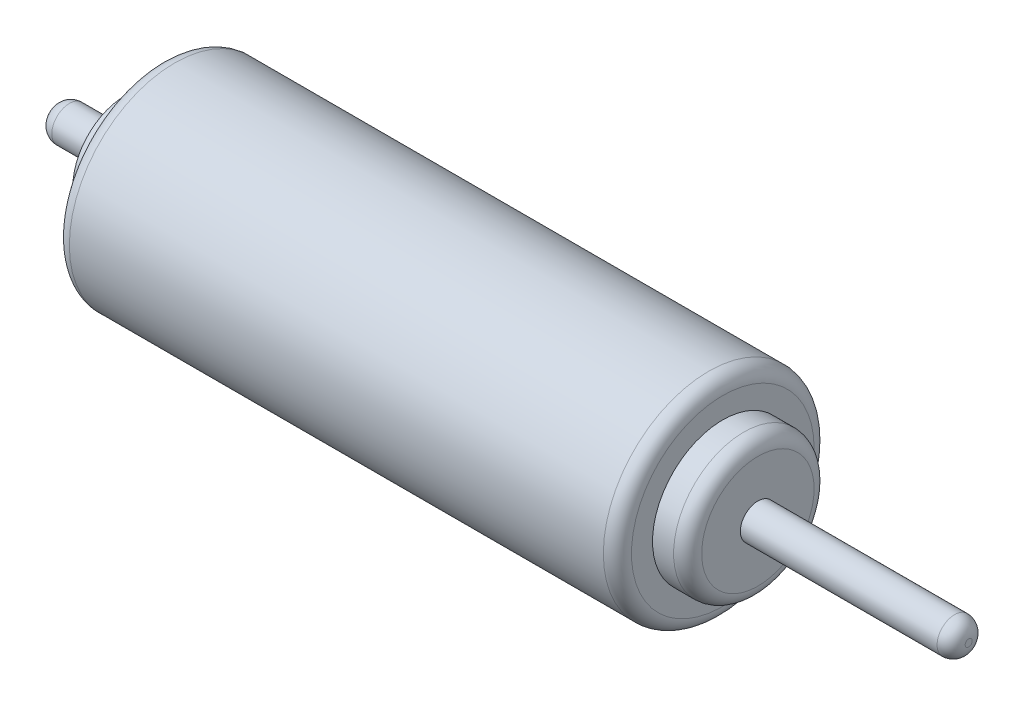
ISO-10303-21;
HEADER;
FILE_DESCRIPTION(('STEP AP214'),'2;1');
FILE_NAME('part.step','',(''),(''),'','','');
FILE_SCHEMA(('AUTOMOTIVE_DESIGN { 1 0 10303 214 1 1 1 1 }'));
ENDSEC;
DATA;
#1=APPLICATION_CONTEXT('core data for automotive mechanical design processes');
#2=APPLICATION_PROTOCOL_DEFINITION('international standard','automotive_design',2000,#1);
#3=PRODUCT_CONTEXT('',#1,'mechanical');
#4=PRODUCT('Part','Part','',(#3));
#5=PRODUCT_RELATED_PRODUCT_CATEGORY('part','',(#4));
#6=PRODUCT_DEFINITION_FORMATION('','',#4);
#7=PRODUCT_DEFINITION_CONTEXT('part definition',#1,'design');
#8=PRODUCT_DEFINITION('design','',#6,#7);
#9=PRODUCT_DEFINITION_SHAPE('','',#8);
#10=(LENGTH_UNIT() NAMED_UNIT(*) SI_UNIT(.MILLI.,.METRE.));
#11=(NAMED_UNIT(*) PLANE_ANGLE_UNIT() SI_UNIT($,.RADIAN.));
#12=(NAMED_UNIT(*) SI_UNIT($,.STERADIAN.) SOLID_ANGLE_UNIT());
#13=UNCERTAINTY_MEASURE_WITH_UNIT(LENGTH_MEASURE(1.E-05),#10,'distance_accuracy_value','');
#14=(GEOMETRIC_REPRESENTATION_CONTEXT(3) GLOBAL_UNCERTAINTY_ASSIGNED_CONTEXT((#13)) GLOBAL_UNIT_ASSIGNED_CONTEXT((#10,
#11,#12)) REPRESENTATION_CONTEXT('',''));
#15=CARTESIAN_POINT('',(0.,0.,0.));
#16=DIRECTION('',(0.,0.,1.));
#17=DIRECTION('',(1.,0.,0.));
#18=AXIS2_PLACEMENT_3D('',#15,#16,#17);
#19=CARTESIAN_POINT('',(80.,0.,0.));
#20=DIRECTION('',(-1.,0.,0.));
#21=DIRECTION('',(0.,0.,1.));
#22=AXIS2_PLACEMENT_3D('',#19,#20,#21);
#23=CYLINDRICAL_SURFACE('',#22,15.);
#24=CARTESIAN_POINT('',(2.,0.,0.));
#25=DIRECTION('',(1.,0.,0.));
#26=DIRECTION('',(0.,0.,-1.));
#27=AXIS2_PLACEMENT_3D('',#24,#25,#26);
#28=CIRCLE('',#27,15.);
#29=CARTESIAN_POINT('',(2.,0.,-15.));
#30=VERTEX_POINT('',#29);
#31=EDGE_CURVE('E60',#30,#30,#28,.T.);
#32=ORIENTED_EDGE('',*,*,#31,.T.);
#33=EDGE_LOOP('',(#32));
#34=FACE_BOUND('',#33,.T.);
#35=CARTESIAN_POINT('',(78.,0.,0.));
#36=DIRECTION('',(1.,0.,0.));
#37=DIRECTION('',(0.,0.,-1.));
#38=AXIS2_PLACEMENT_3D('',#35,#36,#37);
#39=CIRCLE('',#38,15.);
#40=CARTESIAN_POINT('',(78.,0.,-15.));
#41=VERTEX_POINT('',#40);
#42=EDGE_CURVE('E69',#41,#41,#39,.F.);
#43=ORIENTED_EDGE('',*,*,#42,.T.);
#44=EDGE_LOOP('',(#43));
#45=FACE_BOUND('',#44,.T.);
#46=ADVANCED_FACE('F33',(#34,#45),#23,.T.);
#47=CARTESIAN_POINT('',(80.,0.,0.));
#48=DIRECTION('',(1.,0.,0.));
#49=DIRECTION('',(0.,0.,-1.));
#50=AXIS2_PLACEMENT_3D('',#47,#48,#49);
#51=PLANE('',#50);
#52=CARTESIAN_POINT('',(80.,0.,0.));
#53=DIRECTION('',(1.,0.,0.));
#54=DIRECTION('',(0.,0.,-1.));
#55=AXIS2_PLACEMENT_3D('',#52,#53,#54);
#56=CIRCLE('',#55,13.);
#57=CARTESIAN_POINT('',(80.,0.,-13.));
#58=VERTEX_POINT('',#57);
#59=EDGE_CURVE('E72',#58,#58,#56,.T.);
#60=ORIENTED_EDGE('',*,*,#59,.T.);
#61=EDGE_LOOP('',(#60));
#62=FACE_BOUND('',#61,.T.);
#63=CARTESIAN_POINT('',(80.,0.,0.));
#64=DIRECTION('',(1.,0.,0.));
#65=DIRECTION('',(0.,0.,-1.));
#66=AXIS2_PLACEMENT_3D('',#63,#64,#65);
#67=CIRCLE('',#66,10.);
#68=CARTESIAN_POINT('',(80.,0.,-10.));
#69=VERTEX_POINT('',#68);
#70=EDGE_CURVE('E76',#69,#69,#67,.T.);
#71=ORIENTED_EDGE('',*,*,#70,.F.);
#72=EDGE_LOOP('',(#71));
#73=FACE_BOUND('',#72,.T.);
#74=ADVANCED_FACE('F106',(#62,#73),#51,.T.);
#75=CARTESIAN_POINT('',(0.,0.,0.));
#76=DIRECTION('',(1.,0.,0.));
#77=DIRECTION('',(0.,0.,-1.));
#78=AXIS2_PLACEMENT_3D('',#75,#76,#77);
#79=PLANE('',#78);
#80=CARTESIAN_POINT('',(0.,0.,0.));
#81=DIRECTION('',(1.,0.,0.));
#82=DIRECTION('',(0.,0.,-1.));
#83=AXIS2_PLACEMENT_3D('',#80,#81,#82);
#84=CIRCLE('',#83,7.5);
#85=CARTESIAN_POINT('',(0.,0.,-7.5));
#86=VERTEX_POINT('',#85);
#87=EDGE_CURVE('E54',#86,#86,#84,.F.);
#88=ORIENTED_EDGE('',*,*,#87,.F.);
#89=EDGE_LOOP('',(#88));
#90=FACE_BOUND('',#89,.T.);
#91=CARTESIAN_POINT('',(0.,0.,0.));
#92=DIRECTION('',(1.,0.,0.));
#93=DIRECTION('',(0.,0.,-1.));
#94=AXIS2_PLACEMENT_3D('',#91,#92,#93);
#95=CIRCLE('',#94,13.);
#96=CARTESIAN_POINT('',(0.,0.,-13.));
#97=VERTEX_POINT('',#96);
#98=EDGE_CURVE('E57',#97,#97,#95,.F.);
#99=ORIENTED_EDGE('',*,*,#98,.T.);
#100=EDGE_LOOP('',(#99));
#101=FACE_BOUND('',#100,.T.);
#102=ADVANCED_FACE('F102',(#90,#101),#79,.F.);
#103=CARTESIAN_POINT('',(85.,0.,0.));
#104=DIRECTION('',(-1.,0.,0.));
#105=DIRECTION('',(0.,0.,1.));
#106=AXIS2_PLACEMENT_3D('',#103,#104,#105);
#107=CYLINDRICAL_SURFACE('',#106,10.);
#108=CARTESIAN_POINT('',(83.,0.,0.));
#109=DIRECTION('',(1.,0.,0.));
#110=DIRECTION('',(0.,0.,-1.));
#111=AXIS2_PLACEMENT_3D('',#108,#109,#110);
#112=CIRCLE('',#111,10.);
#113=CARTESIAN_POINT('',(83.,0.,-10.));
#114=VERTEX_POINT('',#113);
#115=EDGE_CURVE('E63',#114,#114,#112,.F.);
#116=ORIENTED_EDGE('',*,*,#115,.T.);
#117=EDGE_LOOP('',(#116));
#118=FACE_BOUND('',#117,.T.);
#119=ORIENTED_EDGE('',*,*,#70,.T.);
#120=EDGE_LOOP('',(#119));
#121=FACE_BOUND('',#120,.T.);
#122=ADVANCED_FACE('F105',(#118,#121),#107,.T.);
#123=CARTESIAN_POINT('',(85.,0.,0.));
#124=DIRECTION('',(1.,0.,0.));
#125=DIRECTION('',(0.,0.,-1.));
#126=AXIS2_PLACEMENT_3D('',#123,#124,#125);
#127=PLANE('',#126);
#128=CARTESIAN_POINT('',(85.,0.,0.));
#129=DIRECTION('',(1.,0.,0.));
#130=DIRECTION('',(0.,0.,-1.));
#131=AXIS2_PLACEMENT_3D('',#128,#129,#130);
#132=CIRCLE('',#131,8.);
#133=CARTESIAN_POINT('',(85.,0.,-8.));
#134=VERTEX_POINT('',#133);
#135=EDGE_CURVE('E66',#134,#134,#132,.T.);
#136=ORIENTED_EDGE('',*,*,#135,.T.);
#137=EDGE_LOOP('',(#136));
#138=FACE_BOUND('',#137,.T.);
#139=CARTESIAN_POINT('',(85.,0.,0.));
#140=DIRECTION('',(1.,0.,0.));
#141=DIRECTION('',(0.,0.,-1.));
#142=AXIS2_PLACEMENT_3D('',#139,#140,#141);
#143=CIRCLE('',#142,2.5);
#144=CARTESIAN_POINT('',(85.,0.,-2.5));
#145=VERTEX_POINT('',#144);
#146=EDGE_CURVE('E75',#145,#145,#143,.T.);
#147=ORIENTED_EDGE('',*,*,#146,.F.);
#148=EDGE_LOOP('',(#147));
#149=FACE_BOUND('',#148,.T.);
#150=ADVANCED_FACE('F134',(#138,#149),#127,.T.);
#151=CARTESIAN_POINT('',(115.,0.,0.));
#152=DIRECTION('',(-1.,0.,0.));
#153=DIRECTION('',(0.,0.,1.));
#154=AXIS2_PLACEMENT_3D('',#151,#152,#153);
#155=CYLINDRICAL_SURFACE('',#154,2.5);
#156=CARTESIAN_POINT('',(113.,0.,0.));
#157=DIRECTION('',(1.,0.,0.));
#158=DIRECTION('',(0.,0.,-1.));
#159=AXIS2_PLACEMENT_3D('',#156,#157,#158);
#160=CIRCLE('',#159,2.5);
#161=CARTESIAN_POINT('',(113.,0.,-2.5));
#162=VERTEX_POINT('',#161);
#163=EDGE_CURVE('E44',#162,#162,#160,.F.);
#164=ORIENTED_EDGE('',*,*,#163,.T.);
#165=EDGE_LOOP('',(#164));
#166=FACE_BOUND('',#165,.T.);
#167=ORIENTED_EDGE('',*,*,#146,.T.);
#168=EDGE_LOOP('',(#167));
#169=FACE_BOUND('',#168,.T.);
#170=ADVANCED_FACE('F140',(#166,#169),#155,.T.);
#171=CARTESIAN_POINT('',(115.,0.,0.));
#172=DIRECTION('',(1.,0.,0.));
#173=DIRECTION('',(0.,0.,-1.));
#174=AXIS2_PLACEMENT_3D('',#171,#172,#173);
#175=PLANE('',#174);
#176=CARTESIAN_POINT('',(115.,0.,0.));
#177=DIRECTION('',(1.,0.,0.));
#178=DIRECTION('',(0.,0.,-1.));
#179=AXIS2_PLACEMENT_3D('',#176,#177,#178);
#180=CIRCLE('',#179,0.5);
#181=CARTESIAN_POINT('',(115.,0.,-0.5));
#182=VERTEX_POINT('',#181);
#183=EDGE_CURVE('E48',#182,#182,#180,.T.);
#184=ORIENTED_EDGE('',*,*,#183,.T.);
#185=EDGE_LOOP('',(#184));
#186=FACE_BOUND('',#185,.T.);
#187=ADVANCED_FACE('F124',(#186),#175,.T.);
#188=CARTESIAN_POINT('',(78.,0.,0.));
#189=DIRECTION('',(1.,0.,0.));
#190=DIRECTION('',(0.,0.,-1.));
#191=AXIS2_PLACEMENT_3D('',#188,#189,#190);
#192=TOROIDAL_SURFACE('',#191,13.,2.);
#193=ORIENTED_EDGE('',*,*,#42,.F.);
#194=EDGE_LOOP('',(#193));
#195=FACE_BOUND('',#194,.T.);
#196=ORIENTED_EDGE('',*,*,#59,.F.);
#197=EDGE_LOOP('',(#196));
#198=FACE_BOUND('',#197,.T.);
#199=ADVANCED_FACE('F121',(#195,#198),#192,.T.);
#200=CARTESIAN_POINT('',(83.,0.,0.));
#201=DIRECTION('',(1.,0.,0.));
#202=DIRECTION('',(0.,0.,-1.));
#203=AXIS2_PLACEMENT_3D('',#200,#201,#202);
#204=TOROIDAL_SURFACE('',#203,8.,2.);
#205=ORIENTED_EDGE('',*,*,#115,.F.);
#206=EDGE_LOOP('',(#205));
#207=FACE_BOUND('',#206,.T.);
#208=ORIENTED_EDGE('',*,*,#135,.F.);
#209=EDGE_LOOP('',(#208));
#210=FACE_BOUND('',#209,.T.);
#211=ADVANCED_FACE('F112',(#207,#210),#204,.T.);
#212=CARTESIAN_POINT('',(2.,0.,0.));
#213=DIRECTION('',(1.,0.,0.));
#214=DIRECTION('',(0.,0.,-1.));
#215=AXIS2_PLACEMENT_3D('',#212,#213,#214);
#216=TOROIDAL_SURFACE('',#215,13.,2.);
#217=ORIENTED_EDGE('',*,*,#98,.F.);
#218=EDGE_LOOP('',(#217));
#219=FACE_BOUND('',#218,.T.);
#220=ORIENTED_EDGE('',*,*,#31,.F.);
#221=EDGE_LOOP('',(#220));
#222=FACE_BOUND('',#221,.T.);
#223=ADVANCED_FACE('F98',(#219,#222),#216,.T.);
#224=CARTESIAN_POINT('',(-5.,0.,0.));
#225=DIRECTION('',(1.,0.,0.));
#226=DIRECTION('',(0.,0.,-1.));
#227=AXIS2_PLACEMENT_3D('',#224,#225,#226);
#228=CYLINDRICAL_SURFACE('',#227,7.5);
#229=CARTESIAN_POINT('',(-5.,0.,0.));
#230=DIRECTION('',(-1.,0.,0.));
#231=DIRECTION('',(0.,0.,1.));
#232=AXIS2_PLACEMENT_3D('',#229,#230,#231);
#233=CIRCLE('',#232,7.5);
#234=CARTESIAN_POINT('',(-5.,0.,7.5));
#235=VERTEX_POINT('',#234);
#236=EDGE_CURVE('E79',#235,#235,#233,.T.);
#237=ORIENTED_EDGE('',*,*,#236,.F.);
#238=EDGE_LOOP('',(#237));
#239=FACE_BOUND('',#238,.T.);
#240=ORIENTED_EDGE('',*,*,#87,.T.);
#241=EDGE_LOOP('',(#240));
#242=FACE_BOUND('',#241,.T.);
#243=ADVANCED_FACE('F92',(#239,#242),#228,.T.);
#244=CARTESIAN_POINT('',(-5.,0.,0.));
#245=DIRECTION('',(-1.,0.,0.));
#246=DIRECTION('',(0.,0.,1.));
#247=AXIS2_PLACEMENT_3D('',#244,#245,#246);
#248=PLANE('',#247);
#249=CARTESIAN_POINT('',(-5.,0.,0.));
#250=DIRECTION('',(-1.,0.,0.));
#251=DIRECTION('',(0.,0.,1.));
#252=AXIS2_PLACEMENT_3D('',#249,#250,#251);
#253=CIRCLE('',#252,2.5);
#254=CARTESIAN_POINT('',(-5.,0.,2.5));
#255=VERTEX_POINT('',#254);
#256=EDGE_CURVE('E53',#255,#255,#253,.T.);
#257=ORIENTED_EDGE('',*,*,#256,.F.);
#258=EDGE_LOOP('',(#257));
#259=FACE_BOUND('',#258,.T.);
#260=ORIENTED_EDGE('',*,*,#236,.T.);
#261=EDGE_LOOP('',(#260));
#262=FACE_BOUND('',#261,.T.);
#263=ADVANCED_FACE('F89',(#259,#262),#248,.T.);
#264=CARTESIAN_POINT('',(-15.,0.,0.));
#265=DIRECTION('',(1.,0.,0.));
#266=DIRECTION('',(0.,0.,-1.));
#267=AXIS2_PLACEMENT_3D('',#264,#265,#266);
#268=CYLINDRICAL_SURFACE('',#267,2.5);
#269=CARTESIAN_POINT('',(-13.,0.,0.));
#270=DIRECTION('',(-1.,0.,0.));
#271=DIRECTION('',(0.,0.,1.));
#272=AXIS2_PLACEMENT_3D('',#269,#270,#271);
#273=CIRCLE('',#272,2.5);
#274=CARTESIAN_POINT('',(-13.,0.,2.5));
#275=VERTEX_POINT('',#274);
#276=EDGE_CURVE('E10',#275,#275,#273,.F.);
#277=ORIENTED_EDGE('',*,*,#276,.T.);
#278=EDGE_LOOP('',(#277));
#279=FACE_BOUND('',#278,.T.);
#280=ORIENTED_EDGE('',*,*,#256,.T.);
#281=EDGE_LOOP('',(#280));
#282=FACE_BOUND('',#281,.T.);
#283=ADVANCED_FACE('F87',(#279,#282),#268,.T.);
#284=CARTESIAN_POINT('',(-15.,0.,0.));
#285=DIRECTION('',(-1.,0.,0.));
#286=DIRECTION('',(0.,0.,1.));
#287=AXIS2_PLACEMENT_3D('',#284,#285,#286);
#288=PLANE('',#287);
#289=CARTESIAN_POINT('',(-15.,0.,0.));
#290=DIRECTION('',(-1.,0.,0.));
#291=DIRECTION('',(0.,0.,1.));
#292=AXIS2_PLACEMENT_3D('',#289,#290,#291);
#293=CIRCLE('',#292,0.5);
#294=CARTESIAN_POINT('',(-15.,0.,0.5));
#295=VERTEX_POINT('',#294);
#296=EDGE_CURVE('E40',#295,#295,#293,.T.);
#297=ORIENTED_EDGE('',*,*,#296,.T.);
#298=EDGE_LOOP('',(#297));
#299=FACE_BOUND('',#298,.T.);
#300=ADVANCED_FACE('F149',(#299),#288,.T.);
#301=CARTESIAN_POINT('',(113.,0.,0.));
#302=DIRECTION('',(1.,0.,0.));
#303=DIRECTION('',(0.,0.,-1.));
#304=AXIS2_PLACEMENT_3D('',#301,#302,#303);
#305=DEGENERATE_TOROIDAL_SURFACE('',#304,0.5,2.,.T.);
#306=ORIENTED_EDGE('',*,*,#163,.F.);
#307=EDGE_LOOP('',(#306));
#308=FACE_BOUND('',#307,.T.);
#309=ORIENTED_EDGE('',*,*,#183,.F.);
#310=EDGE_LOOP('',(#309));
#311=FACE_BOUND('',#310,.T.);
#312=ADVANCED_FACE('F147',(#308,#311),#305,.T.);
#313=CARTESIAN_POINT('',(-13.,0.,0.));
#314=DIRECTION('',(-1.,0.,0.));
#315=DIRECTION('',(0.,0.,1.));
#316=AXIS2_PLACEMENT_3D('',#313,#314,#315);
#317=DEGENERATE_TOROIDAL_SURFACE('',#316,0.5,2.,.T.);
#318=ORIENTED_EDGE('',*,*,#276,.F.);
#319=EDGE_LOOP('',(#318));
#320=FACE_BOUND('',#319,.T.);
#321=ORIENTED_EDGE('',*,*,#296,.F.);
#322=EDGE_LOOP('',(#321));
#323=FACE_BOUND('',#322,.T.);
#324=ADVANCED_FACE('F35',(#320,#323),#317,.T.);
#325=CLOSED_SHELL('',(#46,#74,#102,#122,#150,#170,#187,#199,#211,#223,#243,#263,#283,#300,#312,#324));
#326=MANIFOLD_SOLID_BREP('B2',#325);
#327=ADVANCED_BREP_SHAPE_REPRESENTATION('',(#18,#326),#14);
#328=SHAPE_DEFINITION_REPRESENTATION(#9,#327);
ENDSEC;
END-ISO-10303-21;
